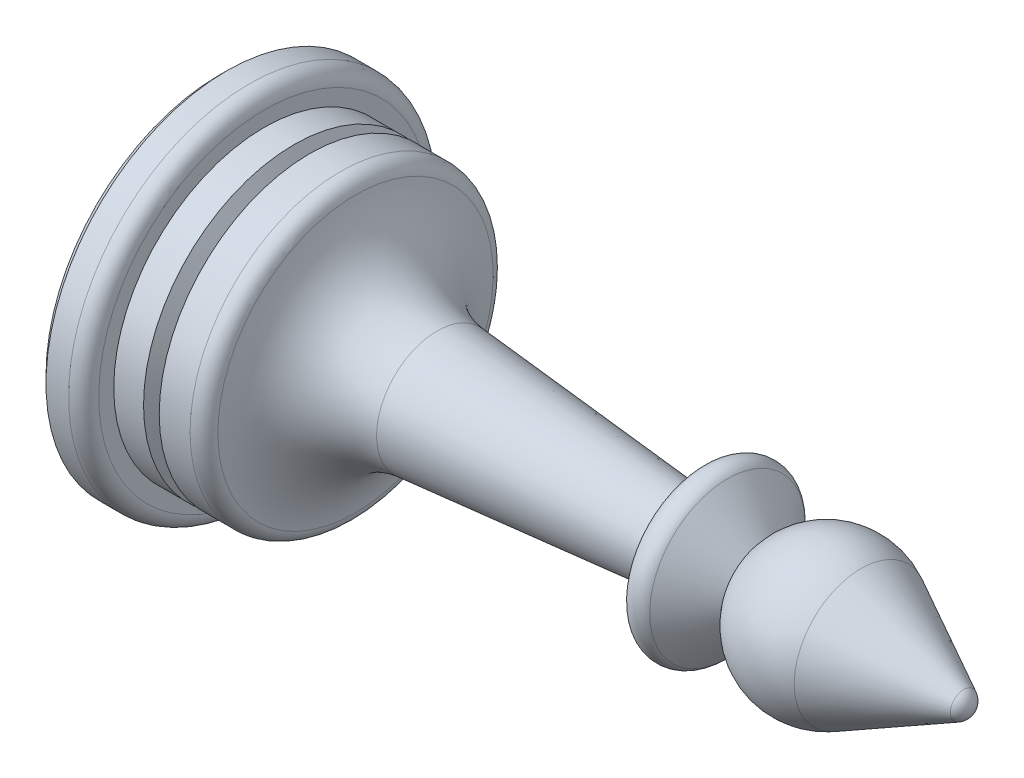
ISO-10303-21;
HEADER;
FILE_DESCRIPTION(('STEP AP214'),'2;1');
FILE_NAME('part.step','',(''),(''),'','','');
FILE_SCHEMA(('AUTOMOTIVE_DESIGN { 1 0 10303 214 1 1 1 1 }'));
ENDSEC;
DATA;
#1=APPLICATION_CONTEXT('core data for automotive mechanical design processes');
#2=APPLICATION_PROTOCOL_DEFINITION('international standard','automotive_design',2000,#1);
#3=PRODUCT_CONTEXT('',#1,'mechanical');
#4=PRODUCT('Part','Part','',(#3));
#5=PRODUCT_RELATED_PRODUCT_CATEGORY('part','',(#4));
#6=PRODUCT_DEFINITION_FORMATION('','',#4);
#7=PRODUCT_DEFINITION_CONTEXT('part definition',#1,'design');
#8=PRODUCT_DEFINITION('design','',#6,#7);
#9=PRODUCT_DEFINITION_SHAPE('','',#8);
#10=(LENGTH_UNIT() NAMED_UNIT(*) SI_UNIT(.MILLI.,.METRE.));
#11=(NAMED_UNIT(*) PLANE_ANGLE_UNIT() SI_UNIT($,.RADIAN.));
#12=(NAMED_UNIT(*) SI_UNIT($,.STERADIAN.) SOLID_ANGLE_UNIT());
#13=UNCERTAINTY_MEASURE_WITH_UNIT(LENGTH_MEASURE(1.E-05),#10,'distance_accuracy_value','');
#14=(GEOMETRIC_REPRESENTATION_CONTEXT(3) GLOBAL_UNCERTAINTY_ASSIGNED_CONTEXT((#13)) GLOBAL_UNIT_ASSIGNED_CONTEXT((#10,
#11,#12)) REPRESENTATION_CONTEXT('',''));
#15=CARTESIAN_POINT('',(0.,0.,0.));
#16=DIRECTION('',(0.,0.,1.));
#17=DIRECTION('',(1.,0.,0.));
#18=AXIS2_PLACEMENT_3D('',#15,#16,#17);
#19=CARTESIAN_POINT('',(0.,0.,0.));
#20=DIRECTION('',(-1.,0.,0.));
#21=DIRECTION('',(0.,-1.,0.));
#22=AXIS2_PLACEMENT_3D('',#19,#20,#21);
#23=CYLINDRICAL_SURFACE('',#22,10.);
#24=CARTESIAN_POINT('',(8.07179676972449,0.,0.));
#25=DIRECTION('',(-1.,0.,0.));
#26=DIRECTION('',(0.,-1.,0.));
#27=AXIS2_PLACEMENT_3D('',#24,#25,#26);
#28=CIRCLE('',#27,10.);
#29=CARTESIAN_POINT('',(8.07179676972449,-10.,0.));
#30=VERTEX_POINT('',#29);
#31=EDGE_CURVE('E62',#30,#30,#28,.T.);
#32=ORIENTED_EDGE('',*,*,#31,.T.);
#33=EDGE_LOOP('',(#32));
#34=FACE_BOUND('',#33,.T.);
#35=CARTESIAN_POINT('',(6.02056705055174,0.,0.));
#36=DIRECTION('',(-1.,0.,0.));
#37=DIRECTION('',(0.,0.,1.));
#38=AXIS2_PLACEMENT_3D('',#35,#36,#37);
#39=CIRCLE('',#38,10.);
#40=CARTESIAN_POINT('',(6.02056705055174,0.,10.));
#41=VERTEX_POINT('',#40);
#42=EDGE_CURVE('E86',#41,#41,#39,.T.);
#43=ORIENTED_EDGE('',*,*,#42,.F.);
#44=EDGE_LOOP('',(#43));
#45=FACE_BOUND('',#44,.T.);
#46=ADVANCED_FACE('F30',(#34,#45),#23,.T.);
#47=CARTESIAN_POINT('',(49.,0.,0.));
#48=DIRECTION('',(-1.,0.,0.));
#49=DIRECTION('',(0.,1.,0.));
#50=AXIS2_PLACEMENT_3D('',#47,#48,#49);
#51=SPHERICAL_SURFACE('',#50,1.);
#52=CARTESIAN_POINT('',(49.4613677742142,0.,0.));
#53=DIRECTION('',(-1.,0.,0.));
#54=DIRECTION('',(0.,-1.,0.));
#55=AXIS2_PLACEMENT_3D('',#52,#53,#54);
#56=CIRCLE('',#55,0.887208981535134);
#57=CARTESIAN_POINT('',(49.4613677742142,-0.887208981535133,0.));
#58=VERTEX_POINT('',#57);
#59=EDGE_CURVE('E10',#58,#58,#56,.T.);
#60=ORIENTED_EDGE('',*,*,#59,.F.);
#61=EDGE_LOOP('',(#60));
#62=FACE_BOUND('',#61,.T.);
#63=ADVANCED_FACE('F32',(#62),#51,.T.);
#64=CARTESIAN_POINT('',(49.4613677742142,0.,0.));
#65=DIRECTION('',(-1.,0.,0.));
#66=DIRECTION('',(0.,-1.,0.));
#67=AXIS2_PLACEMENT_3D('',#64,#65,#66);
#68=CONICAL_SURFACE('',#67,0.887208981535134,0.47953624121909);
#69=CARTESIAN_POINT('',(42.6369658899934,0.,0.));
#70=DIRECTION('',(-1.,0.,0.));
#71=DIRECTION('',(0.,-1.,0.));
#72=AXIS2_PLACEMENT_3D('',#69,#70,#71);
#73=CIRCLE('',#72,4.43604490767565);
#74=CARTESIAN_POINT('',(42.6369658899934,-4.43604490767565,0.));
#75=VERTEX_POINT('',#74);
#76=EDGE_CURVE('E37',#75,#75,#73,.T.);
#77=ORIENTED_EDGE('',*,*,#76,.F.);
#78=EDGE_LOOP('',(#77));
#79=FACE_BOUND('',#78,.T.);
#80=ORIENTED_EDGE('',*,*,#59,.T.);
#81=EDGE_LOOP('',(#80));
#82=FACE_BOUND('',#81,.T.);
#83=ADVANCED_FACE('F160',(#79,#82),#68,.T.);
#84=CARTESIAN_POINT('',(40.3301270189222,0.,0.));
#85=DIRECTION('',(-1.,0.,0.));
#86=DIRECTION('',(0.,1.,0.));
#87=AXIS2_PLACEMENT_3D('',#84,#85,#86);
#88=SPHERICAL_SURFACE('',#87,5.);
#89=CARTESIAN_POINT('',(36.,0.,0.));
#90=DIRECTION('',(-1.,0.,0.));
#91=DIRECTION('',(0.,-1.,0.));
#92=AXIS2_PLACEMENT_3D('',#89,#90,#91);
#93=CIRCLE('',#92,2.5);
#94=CARTESIAN_POINT('',(36.,-2.5,0.));
#95=VERTEX_POINT('',#94);
#96=EDGE_CURVE('E41',#95,#95,#93,.T.);
#97=ORIENTED_EDGE('',*,*,#96,.F.);
#98=EDGE_LOOP('',(#97));
#99=FACE_BOUND('',#98,.T.);
#100=ORIENTED_EDGE('',*,*,#76,.T.);
#101=EDGE_LOOP('',(#100));
#102=FACE_BOUND('',#101,.T.);
#103=ADVANCED_FACE('F182',(#99,#102),#88,.T.);
#104=CARTESIAN_POINT('',(36.,0.,0.));
#105=DIRECTION('',(-1.,0.,0.));
#106=DIRECTION('',(0.,-1.,0.));
#107=AXIS2_PLACEMENT_3D('',#104,#105,#106);
#108=CONICAL_SURFACE('',#107,2.5,0.872664625997168);
#109=CARTESIAN_POINT('',(33.766044443119,0.,0.));
#110=DIRECTION('',(-1.,0.,0.));
#111=DIRECTION('',(0.,-1.,0.));
#112=AXIS2_PLACEMENT_3D('',#109,#110,#111);
#113=CIRCLE('',#112,5.16232456060877);
#114=CARTESIAN_POINT('',(33.766044443119,-5.16232456060877,0.));
#115=VERTEX_POINT('',#114);
#116=EDGE_CURVE('E45',#115,#115,#113,.T.);
#117=ORIENTED_EDGE('',*,*,#116,.F.);
#118=EDGE_LOOP('',(#117));
#119=FACE_BOUND('',#118,.T.);
#120=ORIENTED_EDGE('',*,*,#96,.T.);
#121=EDGE_LOOP('',(#120));
#122=FACE_BOUND('',#121,.T.);
#123=ADVANCED_FACE('F178',(#119,#122),#108,.T.);
#124=CARTESIAN_POINT('',(33.,0.,0.));
#125=DIRECTION('',(-1.,0.,0.));
#126=DIRECTION('',(0.,-1.,0.));
#127=AXIS2_PLACEMENT_3D('',#124,#125,#126);
#128=TOROIDAL_SURFACE('',#127,4.51953695092224,1.);
#129=CARTESIAN_POINT('',(32.,0.,0.));
#130=DIRECTION('',(-1.,0.,0.));
#131=DIRECTION('',(0.,-1.,0.));
#132=AXIS2_PLACEMENT_3D('',#129,#130,#131);
#133=CIRCLE('',#132,4.51953695092223);
#134=CARTESIAN_POINT('',(32.,-4.51953695092223,0.));
#135=VERTEX_POINT('',#134);
#136=EDGE_CURVE('E50',#135,#135,#133,.T.);
#137=ORIENTED_EDGE('',*,*,#136,.F.);
#138=EDGE_LOOP('',(#137));
#139=FACE_BOUND('',#138,.T.);
#140=ORIENTED_EDGE('',*,*,#116,.T.);
#141=EDGE_LOOP('',(#140));
#142=FACE_BOUND('',#141,.T.);
#143=ADVANCED_FACE('F174',(#139,#142),#128,.T.);
#144=CARTESIAN_POINT('',(32.,2.5,0.));
#145=DIRECTION('',(1.,0.,0.));
#146=DIRECTION('',(0.,1.,0.));
#147=AXIS2_PLACEMENT_3D('',#144,#145,#146);
#148=PLANE('',#147);
#149=CARTESIAN_POINT('',(32.,0.,0.));
#150=DIRECTION('',(-1.,0.,0.));
#151=DIRECTION('',(0.,-1.,0.));
#152=AXIS2_PLACEMENT_3D('',#149,#150,#151);
#153=CIRCLE('',#152,2.5);
#154=CARTESIAN_POINT('',(32.,-2.5,0.));
#155=VERTEX_POINT('',#154);
#156=EDGE_CURVE('E53',#155,#155,#153,.T.);
#157=ORIENTED_EDGE('',*,*,#156,.F.);
#158=EDGE_LOOP('',(#157));
#159=FACE_BOUND('',#158,.T.);
#160=ORIENTED_EDGE('',*,*,#136,.T.);
#161=EDGE_LOOP('',(#160));
#162=FACE_BOUND('',#161,.T.);
#163=ADVANCED_FACE('F170',(#159,#162),#148,.F.);
#164=CARTESIAN_POINT('',(32.,0.,0.));
#165=DIRECTION('',(-1.,0.,0.));
#166=DIRECTION('',(0.,-1.,0.));
#167=AXIS2_PLACEMENT_3D('',#164,#165,#166);
#168=CONICAL_SURFACE('',#167,2.5,0.086687213679939);
#169=CARTESIAN_POINT('',(14.4805278992669,0.,0.));
#170=DIRECTION('',(-1.,0.,0.));
#171=DIRECTION('',(0.,-1.,0.));
#172=AXIS2_PLACEMENT_3D('',#169,#170,#171);
#173=CIRCLE('',#172,4.02252990500497);
#174=CARTESIAN_POINT('',(14.4805278992669,-4.02252990500497,0.));
#175=VERTEX_POINT('',#174);
#176=EDGE_CURVE('E56',#175,#175,#173,.T.);
#177=ORIENTED_EDGE('',*,*,#176,.F.);
#178=EDGE_LOOP('',(#177));
#179=FACE_BOUND('',#178,.T.);
#180=ORIENTED_EDGE('',*,*,#156,.T.);
#181=EDGE_LOOP('',(#180));
#182=FACE_BOUND('',#181,.T.);
#183=ADVANCED_FACE('F166',(#179,#182),#168,.T.);
#184=CARTESIAN_POINT('',(15.,0.,0.));
#185=DIRECTION('',(-1.,0.,0.));
#186=DIRECTION('',(0.,-1.,0.));
#187=AXIS2_PLACEMENT_3D('',#184,#185,#186);
#188=TOROIDAL_SURFACE('',#187,10.,6.);
#189=CARTESIAN_POINT('',(9.06154008833528,0.,0.));
#190=DIRECTION('',(-1.,0.,0.));
#191=DIRECTION('',(0.,-1.,0.));
#192=AXIS2_PLACEMENT_3D('',#189,#190,#191);
#193=CIRCLE('',#192,9.14285714285714);
#194=CARTESIAN_POINT('',(9.06154008833528,-9.14285714285714,0.));
#195=VERTEX_POINT('',#194);
#196=EDGE_CURVE('E59',#195,#195,#193,.T.);
#197=ORIENTED_EDGE('',*,*,#196,.F.);
#198=EDGE_LOOP('',(#197));
#199=FACE_BOUND('',#198,.T.);
#200=ORIENTED_EDGE('',*,*,#176,.T.);
#201=EDGE_LOOP('',(#200));
#202=FACE_BOUND('',#201,.T.);
#203=ADVANCED_FACE('F152',(#199,#202),#188,.F.);
#204=CARTESIAN_POINT('',(8.07179676972449,0.,0.));
#205=DIRECTION('',(-1.,0.,0.));
#206=DIRECTION('',(0.,-1.,0.));
#207=AXIS2_PLACEMENT_3D('',#204,#205,#206);
#208=TOROIDAL_SURFACE('',#207,9.,1.);
#209=ORIENTED_EDGE('',*,*,#31,.F.);
#210=EDGE_LOOP('',(#209));
#211=FACE_BOUND('',#210,.T.);
#212=ORIENTED_EDGE('',*,*,#196,.T.);
#213=EDGE_LOOP('',(#212));
#214=FACE_BOUND('',#213,.T.);
#215=ADVANCED_FACE('F143',(#211,#214),#208,.T.);
#216=CARTESIAN_POINT('',(4.97943294944826,0.,0.));
#217=DIRECTION('',(-1.,0.,0.));
#218=DIRECTION('',(0.,0.,1.));
#219=AXIS2_PLACEMENT_3D('',#216,#217,#218);
#220=CONICAL_SURFACE('',#219,10.,1.09083078249646);
#221=CARTESIAN_POINT('',(5.5,0.,0.));
#222=DIRECTION('',(-1.,0.,0.));
#223=DIRECTION('',(0.,0.,1.));
#224=AXIS2_PLACEMENT_3D('',#221,#222,#223);
#225=CIRCLE('',#224,9.);
#226=CARTESIAN_POINT('',(5.5,0.,9.));
#227=VERTEX_POINT('',#226);
#228=EDGE_CURVE('E83',#227,#227,#225,.T.);
#229=ORIENTED_EDGE('',*,*,#228,.T.);
#230=EDGE_LOOP('',(#229));
#231=FACE_BOUND('',#230,.T.);
#232=CARTESIAN_POINT('',(4.97943294944826,0.,0.));
#233=DIRECTION('',(-1.,0.,0.));
#234=DIRECTION('',(0.,0.,1.));
#235=AXIS2_PLACEMENT_3D('',#232,#233,#234);
#236=CIRCLE('',#235,10.);
#237=CARTESIAN_POINT('',(4.97943294944826,0.,10.));
#238=VERTEX_POINT('',#237);
#239=EDGE_CURVE('E80',#238,#238,#236,.T.);
#240=ORIENTED_EDGE('',*,*,#239,.F.);
#241=EDGE_LOOP('',(#240));
#242=FACE_BOUND('',#241,.T.);
#243=ADVANCED_FACE('F141',(#231,#242),#220,.T.);
#244=CARTESIAN_POINT('',(5.5,0.,0.));
#245=DIRECTION('',(1.,0.,0.));
#246=DIRECTION('',(0.,0.,-1.));
#247=AXIS2_PLACEMENT_3D('',#244,#245,#246);
#248=CONICAL_SURFACE('',#247,9.,1.09083078249646);
#249=ORIENTED_EDGE('',*,*,#42,.T.);
#250=EDGE_LOOP('',(#249));
#251=FACE_BOUND('',#250,.T.);
#252=ORIENTED_EDGE('',*,*,#228,.F.);
#253=EDGE_LOOP('',(#252));
#254=FACE_BOUND('',#253,.T.);
#255=ADVANCED_FACE('F109',(#251,#254),#248,.T.);
#256=CARTESIAN_POINT('',(0.,0.,0.));
#257=DIRECTION('',(1.,0.,0.));
#258=DIRECTION('',(0.,1.,0.));
#259=AXIS2_PLACEMENT_3D('',#256,#257,#258);
#260=PLANE('',#259);
#261=CARTESIAN_POINT('',(0.,0.,0.));
#262=DIRECTION('',(-1.,0.,0.));
#263=DIRECTION('',(0.,-1.,0.));
#264=AXIS2_PLACEMENT_3D('',#261,#262,#263);
#265=CIRCLE('',#264,6.);
#266=CARTESIAN_POINT('',(0.,-6.,0.));
#267=VERTEX_POINT('',#266);
#268=EDGE_CURVE('E90',#267,#267,#265,.T.);
#269=ORIENTED_EDGE('',*,*,#268,.F.);
#270=EDGE_LOOP('',(#269));
#271=FACE_BOUND('',#270,.T.);
#272=CARTESIAN_POINT('',(0.,0.,0.));
#273=DIRECTION('',(-1.,0.,0.));
#274=DIRECTION('',(0.,-1.,0.));
#275=AXIS2_PLACEMENT_3D('',#272,#273,#274);
#276=CIRCLE('',#275,11.5);
#277=CARTESIAN_POINT('',(0.,-11.5,0.));
#278=VERTEX_POINT('',#277);
#279=EDGE_CURVE('E77',#278,#278,#276,.T.);
#280=ORIENTED_EDGE('',*,*,#279,.T.);
#281=EDGE_LOOP('',(#280));
#282=FACE_BOUND('',#281,.T.);
#283=ADVANCED_FACE('F105',(#271,#282),#260,.F.);
#284=CARTESIAN_POINT('',(0.5,0.,0.));
#285=DIRECTION('',(1.,0.,0.));
#286=DIRECTION('',(0.,1.,0.));
#287=AXIS2_PLACEMENT_3D('',#284,#285,#286);
#288=CONICAL_SURFACE('',#287,12.,0.785398163397449);
#289=ORIENTED_EDGE('',*,*,#279,.F.);
#290=EDGE_LOOP('',(#289));
#291=FACE_BOUND('',#290,.T.);
#292=CARTESIAN_POINT('',(0.5,0.,0.));
#293=DIRECTION('',(-1.,0.,0.));
#294=DIRECTION('',(0.,-1.,0.));
#295=AXIS2_PLACEMENT_3D('',#292,#293,#294);
#296=CIRCLE('',#295,12.);
#297=CARTESIAN_POINT('',(0.5,-12.,0.));
#298=VERTEX_POINT('',#297);
#299=EDGE_CURVE('E74',#298,#298,#296,.T.);
#300=ORIENTED_EDGE('',*,*,#299,.T.);
#301=EDGE_LOOP('',(#300));
#302=FACE_BOUND('',#301,.T.);
#303=ADVANCED_FACE('F108',(#291,#302),#288,.T.);
#304=CARTESIAN_POINT('',(0.,0.,0.));
#305=DIRECTION('',(-1.,0.,0.));
#306=DIRECTION('',(0.,-1.,0.));
#307=AXIS2_PLACEMENT_3D('',#304,#305,#306);
#308=CYLINDRICAL_SURFACE('',#307,12.);
#309=ORIENTED_EDGE('',*,*,#299,.F.);
#310=EDGE_LOOP('',(#309));
#311=FACE_BOUND('',#310,.T.);
#312=CARTESIAN_POINT('',(2.,0.,0.));
#313=DIRECTION('',(-1.,0.,0.));
#314=DIRECTION('',(0.,-1.,0.));
#315=AXIS2_PLACEMENT_3D('',#312,#313,#314);
#316=CIRCLE('',#315,12.);
#317=CARTESIAN_POINT('',(2.,-12.,0.));
#318=VERTEX_POINT('',#317);
#319=EDGE_CURVE('E71',#318,#318,#316,.T.);
#320=ORIENTED_EDGE('',*,*,#319,.T.);
#321=EDGE_LOOP('',(#320));
#322=FACE_BOUND('',#321,.T.);
#323=ADVANCED_FACE('F115',(#311,#322),#308,.T.);
#324=CARTESIAN_POINT('',(2.,0.,0.));
#325=DIRECTION('',(-1.,0.,0.));
#326=DIRECTION('',(0.,-1.,0.));
#327=AXIS2_PLACEMENT_3D('',#324,#325,#326);
#328=TOROIDAL_SURFACE('',#327,11.,1.);
#329=ORIENTED_EDGE('',*,*,#319,.F.);
#330=EDGE_LOOP('',(#329));
#331=FACE_BOUND('',#330,.T.);
#332=CARTESIAN_POINT('',(3.,0.,0.));
#333=DIRECTION('',(-1.,0.,0.));
#334=DIRECTION('',(0.,-1.,0.));
#335=AXIS2_PLACEMENT_3D('',#332,#333,#334);
#336=CIRCLE('',#335,11.);
#337=CARTESIAN_POINT('',(3.,-11.,0.));
#338=VERTEX_POINT('',#337);
#339=EDGE_CURVE('E68',#338,#338,#336,.T.);
#340=ORIENTED_EDGE('',*,*,#339,.T.);
#341=EDGE_LOOP('',(#340));
#342=FACE_BOUND('',#341,.T.);
#343=ADVANCED_FACE('F121',(#331,#342),#328,.T.);
#344=CARTESIAN_POINT('',(3.,11.,0.));
#345=DIRECTION('',(-1.,0.,0.));
#346=DIRECTION('',(0.,-1.,0.));
#347=AXIS2_PLACEMENT_3D('',#344,#345,#346);
#348=PLANE('',#347);
#349=ORIENTED_EDGE('',*,*,#339,.F.);
#350=EDGE_LOOP('',(#349));
#351=FACE_BOUND('',#350,.T.);
#352=CARTESIAN_POINT('',(3.,0.,0.));
#353=DIRECTION('',(-1.,0.,0.));
#354=DIRECTION('',(0.,-1.,0.));
#355=AXIS2_PLACEMENT_3D('',#352,#353,#354);
#356=CIRCLE('',#355,10.);
#357=CARTESIAN_POINT('',(3.,-10.,0.));
#358=VERTEX_POINT('',#357);
#359=EDGE_CURVE('E65',#358,#358,#356,.T.);
#360=ORIENTED_EDGE('',*,*,#359,.T.);
#361=EDGE_LOOP('',(#360));
#362=FACE_BOUND('',#361,.T.);
#363=ADVANCED_FACE('F127',(#351,#362),#348,.F.);
#364=ORIENTED_EDGE('',*,*,#359,.F.);
#365=EDGE_LOOP('',(#364));
#366=FACE_BOUND('',#365,.T.);
#367=ORIENTED_EDGE('',*,*,#239,.T.);
#368=EDGE_LOOP('',(#367));
#369=FACE_BOUND('',#368,.T.);
#370=ADVANCED_FACE('F101',(#366,#369),#23,.T.);
#371=CARTESIAN_POINT('',(5.,0.,0.));
#372=DIRECTION('',(-1.,0.,0.));
#373=DIRECTION('',(0.,-1.,0.));
#374=AXIS2_PLACEMENT_3D('',#371,#372,#373);
#375=CYLINDRICAL_SURFACE('',#374,6.);
#376=CARTESIAN_POINT('',(5.,0.,0.));
#377=DIRECTION('',(-1.,0.,0.));
#378=DIRECTION('',(0.,-1.,0.));
#379=AXIS2_PLACEMENT_3D('',#376,#377,#378);
#380=CIRCLE('',#379,6.);
#381=CARTESIAN_POINT('',(5.,-6.,0.));
#382=VERTEX_POINT('',#381);
#383=EDGE_CURVE('E89',#382,#382,#380,.T.);
#384=ORIENTED_EDGE('',*,*,#383,.F.);
#385=EDGE_LOOP('',(#384));
#386=FACE_BOUND('',#385,.T.);
#387=ORIENTED_EDGE('',*,*,#268,.T.);
#388=EDGE_LOOP('',(#387));
#389=FACE_BOUND('',#388,.T.);
#390=ADVANCED_FACE('F98',(#386,#389),#375,.F.);
#391=CARTESIAN_POINT('',(5.,0.,0.));
#392=DIRECTION('',(-1.,0.,0.));
#393=DIRECTION('',(0.,-1.,0.));
#394=AXIS2_PLACEMENT_3D('',#391,#392,#393);
#395=PLANE('',#394);
#396=ORIENTED_EDGE('',*,*,#383,.T.);
#397=EDGE_LOOP('',(#396));
#398=FACE_BOUND('',#397,.T.);
#399=ADVANCED_FACE('F96',(#398),#395,.T.);
#400=CLOSED_SHELL('',(#46,#63,#83,#103,#123,#143,#163,#183,#203,#215,#243,#255,#283,#303,#323,
#343,#363,#370,#390,#399));
#401=MANIFOLD_SOLID_BREP('B2',#400);
#402=ADVANCED_BREP_SHAPE_REPRESENTATION('',(#18,#401),#14);
#403=SHAPE_DEFINITION_REPRESENTATION(#9,#402);
ENDSEC;
END-ISO-10303-21;
